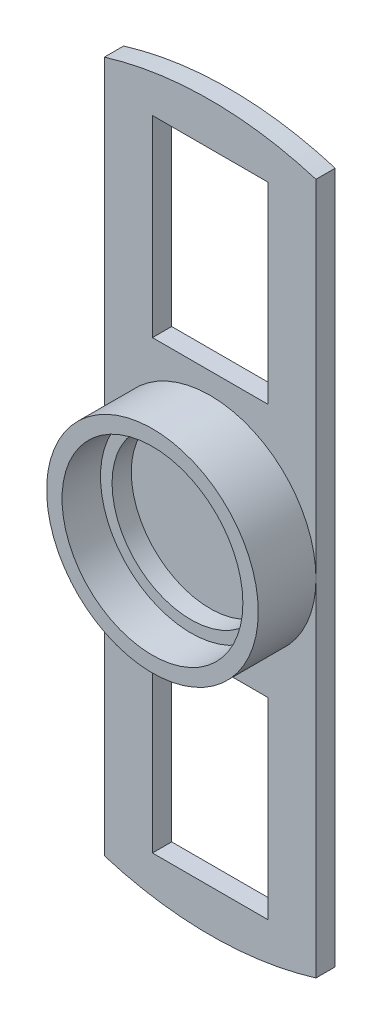
ISO-10303-21;
HEADER;
FILE_DESCRIPTION(('STEP AP214'),'2;1');
FILE_NAME('part.step','',(''),(''),'','','');
FILE_SCHEMA(('AUTOMOTIVE_DESIGN { 1 0 10303 214 1 1 1 1 }'));
ENDSEC;
DATA;
#1=APPLICATION_CONTEXT('core data for automotive mechanical design processes');
#2=APPLICATION_PROTOCOL_DEFINITION('international standard','automotive_design',2000,#1);
#3=PRODUCT_CONTEXT('',#1,'mechanical');
#4=PRODUCT('Part','Part','',(#3));
#5=PRODUCT_RELATED_PRODUCT_CATEGORY('part','',(#4));
#6=PRODUCT_DEFINITION_FORMATION('','',#4);
#7=PRODUCT_DEFINITION_CONTEXT('part definition',#1,'design');
#8=PRODUCT_DEFINITION('design','',#6,#7);
#9=PRODUCT_DEFINITION_SHAPE('','',#8);
#10=(LENGTH_UNIT() NAMED_UNIT(*) SI_UNIT(.MILLI.,.METRE.));
#11=(NAMED_UNIT(*) PLANE_ANGLE_UNIT() SI_UNIT($,.RADIAN.));
#12=(NAMED_UNIT(*) SI_UNIT($,.STERADIAN.) SOLID_ANGLE_UNIT());
#13=UNCERTAINTY_MEASURE_WITH_UNIT(LENGTH_MEASURE(1.E-05),#10,'distance_accuracy_value','');
#14=(GEOMETRIC_REPRESENTATION_CONTEXT(3) GLOBAL_UNCERTAINTY_ASSIGNED_CONTEXT((#13)) GLOBAL_UNIT_ASSIGNED_CONTEXT((#10,
#11,#12)) REPRESENTATION_CONTEXT('',''));
#15=CARTESIAN_POINT('',(0.,0.,0.));
#16=DIRECTION('',(0.,0.,1.));
#17=DIRECTION('',(1.,0.,0.));
#18=AXIS2_PLACEMENT_3D('',#15,#16,#17);
#19=CARTESIAN_POINT('',(0.,0.,10.));
#20=DIRECTION('',(0.,0.,1.));
#21=DIRECTION('',(1.,0.,0.));
#22=AXIS2_PLACEMENT_3D('',#19,#20,#21);
#23=PLANE('',#22);
#24=CARTESIAN_POINT('',(0.,0.,10.));
#25=DIRECTION('',(0.,0.,1.));
#26=DIRECTION('',(1.,0.,0.));
#27=AXIS2_PLACEMENT_3D('',#24,#25,#26);
#28=CIRCLE('',#27,27.5);
#29=CARTESIAN_POINT('',(27.5,0.,10.));
#30=VERTEX_POINT('',#29);
#31=EDGE_CURVE('E226',#30,#30,#28,.T.);
#32=ORIENTED_EDGE('',*,*,#31,.T.);
#33=EDGE_LOOP('',(#32));
#34=FACE_BOUND('',#33,.T.);
#35=CARTESIAN_POINT('',(0.,0.,10.));
#36=DIRECTION('',(0.,0.,1.));
#37=DIRECTION('',(1.,0.,0.));
#38=AXIS2_PLACEMENT_3D('',#35,#36,#37);
#39=CIRCLE('',#38,23.5);
#40=CARTESIAN_POINT('',(23.5,0.,10.));
#41=VERTEX_POINT('',#40);
#42=EDGE_CURVE('E223',#41,#41,#39,.T.);
#43=ORIENTED_EDGE('',*,*,#42,.F.);
#44=EDGE_LOOP('',(#43));
#45=FACE_BOUND('',#44,.T.);
#46=ADVANCED_FACE('F33',(#34,#45),#23,.T.);
#47=CARTESIAN_POINT('',(0.,0.,10.));
#48=DIRECTION('',(0.,0.,-1.));
#49=DIRECTION('',(-1.,0.,0.));
#50=AXIS2_PLACEMENT_3D('',#47,#48,#49);
#51=CYLINDRICAL_SURFACE('',#50,27.5);
#52=ORIENTED_EDGE('',*,*,#31,.F.);
#53=EDGE_LOOP('',(#52));
#54=FACE_BOUND('',#53,.T.);
#55=CARTESIAN_POINT('',(0.,0.,-5.));
#56=DIRECTION('',(0.,0.,-1.));
#57=DIRECTION('',(-1.,0.,0.));
#58=AXIS2_PLACEMENT_3D('',#55,#56,#57);
#59=CIRCLE('',#58,27.5);
#60=CARTESIAN_POINT('',(-27.5,0.,-5.));
#61=VERTEX_POINT('',#60);
#62=CARTESIAN_POINT('',(27.5,0.,-5.));
#63=VERTEX_POINT('',#62);
#64=EDGE_CURVE('E219',#61,#63,#59,.T.);
#65=ORIENTED_EDGE('',*,*,#64,.F.);
#66=EDGE_CURVE('E218',#63,#61,#59,.T.);
#67=ORIENTED_EDGE('',*,*,#66,.F.);
#68=EDGE_LOOP('',(#65,#67));
#69=FACE_BOUND('',#68,.T.);
#70=ADVANCED_FACE('F35',(#54,#69),#51,.T.);
#71=CARTESIAN_POINT('',(0.,0.,10.));
#72=DIRECTION('',(0.,0.,-1.));
#73=DIRECTION('',(-1.,0.,0.));
#74=AXIS2_PLACEMENT_3D('',#71,#72,#73);
#75=CYLINDRICAL_SURFACE('',#74,23.5);
#76=ORIENTED_EDGE('',*,*,#42,.T.);
#77=EDGE_LOOP('',(#76));
#78=FACE_BOUND('',#77,.T.);
#79=CARTESIAN_POINT('',(0.,0.,0.));
#80=DIRECTION('',(0.,0.,1.));
#81=DIRECTION('',(1.,0.,0.));
#82=AXIS2_PLACEMENT_3D('',#79,#80,#81);
#83=CIRCLE('',#82,23.5);
#84=CARTESIAN_POINT('',(23.5,0.,0.));
#85=VERTEX_POINT('',#84);
#86=EDGE_CURVE('E222',#85,#85,#83,.T.);
#87=ORIENTED_EDGE('',*,*,#86,.F.);
#88=EDGE_LOOP('',(#87));
#89=FACE_BOUND('',#88,.T.);
#90=ADVANCED_FACE('F269',(#78,#89),#75,.F.);
#91=CARTESIAN_POINT('',(0.,0.,0.));
#92=DIRECTION('',(0.,0.,-1.));
#93=DIRECTION('',(-1.,0.,0.));
#94=AXIS2_PLACEMENT_3D('',#91,#92,#93);
#95=PLANE('',#94);
#96=CARTESIAN_POINT('',(0.,0.,0.));
#97=DIRECTION('',(0.,0.,-1.));
#98=DIRECTION('',(-1.,0.,0.));
#99=AXIS2_PLACEMENT_3D('',#96,#97,#98);
#100=CIRCLE('',#99,20.5);
#101=CARTESIAN_POINT('',(-20.5,0.,0.));
#102=VERTEX_POINT('',#101);
#103=EDGE_CURVE('E215',#102,#102,#100,.T.);
#104=ORIENTED_EDGE('',*,*,#103,.T.);
#105=EDGE_LOOP('',(#104));
#106=FACE_BOUND('',#105,.T.);
#107=ORIENTED_EDGE('',*,*,#86,.T.);
#108=EDGE_LOOP('',(#107));
#109=FACE_BOUND('',#108,.T.);
#110=ADVANCED_FACE('F275',(#106,#109),#95,.F.);
#111=CARTESIAN_POINT('',(0.,0.,-5.));
#112=DIRECTION('',(0.,0.,1.));
#113=DIRECTION('',(1.,0.,0.));
#114=AXIS2_PLACEMENT_3D('',#111,#112,#113);
#115=CYLINDRICAL_SURFACE('',#114,20.5);
#116=CARTESIAN_POINT('',(0.,0.,-5.));
#117=DIRECTION('',(0.,0.,-1.));
#118=DIRECTION('',(-1.,0.,0.));
#119=AXIS2_PLACEMENT_3D('',#116,#117,#118);
#120=CIRCLE('',#119,20.5);
#121=CARTESIAN_POINT('',(-20.5,0.,-5.));
#122=VERTEX_POINT('',#121);
#123=EDGE_CURVE('E212',#122,#122,#120,.T.);
#124=ORIENTED_EDGE('',*,*,#123,.T.);
#125=EDGE_LOOP('',(#124));
#126=FACE_BOUND('',#125,.T.);
#127=ORIENTED_EDGE('',*,*,#103,.F.);
#128=EDGE_LOOP('',(#127));
#129=FACE_BOUND('',#128,.T.);
#130=ADVANCED_FACE('F279',(#126,#129),#115,.F.);
#131=CARTESIAN_POINT('',(0.,0.,-5.));
#132=DIRECTION('',(0.,0.,-1.));
#133=DIRECTION('',(-1.,0.,0.));
#134=AXIS2_PLACEMENT_3D('',#131,#132,#133);
#135=PLANE('',#134);
#136=ORIENTED_EDGE('',*,*,#123,.F.);
#137=EDGE_LOOP('',(#136));
#138=FACE_BOUND('',#137,.T.);
#139=ADVANCED_FACE('F283',(#138),#135,.F.);
#140=DIRECTION('',(1.,0.,0.));
#141=VECTOR('',#140,1.);
#142=CARTESIAN_POINT('',(-15.,33.,-5.));
#143=LINE('',#142,#141);
#144=CARTESIAN_POINT('',(-15.,33.,-5.));
#145=VERTEX_POINT('',#144);
#146=CARTESIAN_POINT('',(15.,33.,-5.));
#147=VERTEX_POINT('',#146);
#148=EDGE_CURVE('E162',#145,#147,#143,.T.);
#149=ORIENTED_EDGE('',*,*,#148,.F.);
#150=DIRECTION('',(0.,-1.,0.));
#151=VECTOR('',#150,1.);
#152=CARTESIAN_POINT('',(-15.,33.,-5.));
#153=LINE('',#152,#151);
#154=CARTESIAN_POINT('',(-15.,83.,-5.));
#155=VERTEX_POINT('',#154);
#156=EDGE_CURVE('E48',#155,#145,#153,.T.);
#157=ORIENTED_EDGE('',*,*,#156,.F.);
#158=DIRECTION('',(-1.,0.,0.));
#159=VECTOR('',#158,1.);
#160=CARTESIAN_POINT('',(-15.,83.,-5.));
#161=LINE('',#160,#159);
#162=CARTESIAN_POINT('',(15.,83.,-5.));
#163=VERTEX_POINT('',#162);
#164=EDGE_CURVE('E168',#163,#155,#161,.T.);
#165=ORIENTED_EDGE('',*,*,#164,.F.);
#166=DIRECTION('',(0.,1.,0.));
#167=VECTOR('',#166,1.);
#168=CARTESIAN_POINT('',(15.,33.,-5.));
#169=LINE('',#168,#167);
#170=EDGE_CURVE('E165',#147,#163,#169,.T.);
#171=ORIENTED_EDGE('',*,*,#170,.F.);
#172=EDGE_LOOP('',(#149,#157,#165,#171));
#173=FACE_BOUND('',#172,.T.);
#174=DIRECTION('',(0.,1.,0.));
#175=VECTOR('',#174,1.);
#176=CARTESIAN_POINT('',(-27.5,89.8874295994718,-5.));
#177=LINE('',#176,#175);
#178=CARTESIAN_POINT('',(-27.5,89.8874295994718,-5.));
#179=VERTEX_POINT('',#178);
#180=EDGE_CURVE('E198',#61,#179,#177,.T.);
#181=ORIENTED_EDGE('',*,*,#180,.F.);
#182=ORIENTED_EDGE('',*,*,#64,.T.);
#183=DIRECTION('',(0.,-1.,0.));
#184=VECTOR('',#183,1.);
#185=CARTESIAN_POINT('',(27.5,89.8874295994718,-5.));
#186=LINE('',#185,#184);
#187=CARTESIAN_POINT('',(27.5,89.8874295994718,-5.));
#188=VERTEX_POINT('',#187);
#189=EDGE_CURVE('E193',#188,#63,#186,.T.);
#190=ORIENTED_EDGE('',*,*,#189,.F.);
#191=CARTESIAN_POINT('',(0.,0.,-5.));
#192=DIRECTION('',(0.,0.,-1.));
#193=DIRECTION('',(-1.,0.,0.));
#194=AXIS2_PLACEMENT_3D('',#191,#192,#193);
#195=CIRCLE('',#194,94.);
#196=EDGE_CURVE('E158',#179,#188,#195,.T.);
#197=ORIENTED_EDGE('',*,*,#196,.F.);
#198=EDGE_LOOP('',(#181,#182,#190,#197));
#199=FACE_BOUND('',#198,.T.);
#200=ADVANCED_FACE('F303',(#173,#199),#135,.F.);
#201=DIRECTION('',(-1.,0.,0.));
#202=VECTOR('',#201,1.);
#203=CARTESIAN_POINT('',(15.,-33.,-5.));
#204=LINE('',#203,#202);
#205=CARTESIAN_POINT('',(15.,-33.,-5.));
#206=VERTEX_POINT('',#205);
#207=CARTESIAN_POINT('',(-15.,-33.,-5.));
#208=VERTEX_POINT('',#207);
#209=EDGE_CURVE('E144',#206,#208,#204,.T.);
#210=ORIENTED_EDGE('',*,*,#209,.F.);
#211=DIRECTION('',(0.,1.,0.));
#212=VECTOR('',#211,1.);
#213=CARTESIAN_POINT('',(15.,-33.,-5.));
#214=LINE('',#213,#212);
#215=CARTESIAN_POINT('',(15.,-83.,-5.));
#216=VERTEX_POINT('',#215);
#217=EDGE_CURVE('E56',#216,#206,#214,.T.);
#218=ORIENTED_EDGE('',*,*,#217,.F.);
#219=DIRECTION('',(1.,0.,0.));
#220=VECTOR('',#219,1.);
#221=CARTESIAN_POINT('',(15.,-83.,-5.));
#222=LINE('',#221,#220);
#223=CARTESIAN_POINT('',(-15.,-83.,-5.));
#224=VERTEX_POINT('',#223);
#225=EDGE_CURVE('E151',#224,#216,#222,.T.);
#226=ORIENTED_EDGE('',*,*,#225,.F.);
#227=DIRECTION('',(0.,-1.,0.));
#228=VECTOR('',#227,1.);
#229=CARTESIAN_POINT('',(-15.,-33.,-5.));
#230=LINE('',#229,#228);
#231=EDGE_CURVE('E134',#208,#224,#230,.T.);
#232=ORIENTED_EDGE('',*,*,#231,.F.);
#233=EDGE_LOOP('',(#210,#218,#226,#232));
#234=FACE_BOUND('',#233,.T.);
#235=CARTESIAN_POINT('',(27.5,-89.8874295994718,-5.));
#236=VERTEX_POINT('',#235);
#237=EDGE_CURVE('E192',#63,#236,#186,.T.);
#238=ORIENTED_EDGE('',*,*,#237,.F.);
#239=ORIENTED_EDGE('',*,*,#66,.T.);
#240=CARTESIAN_POINT('',(-27.5,-89.8874295994718,-5.));
#241=VERTEX_POINT('',#240);
#242=EDGE_CURVE('E183',#241,#61,#177,.T.);
#243=ORIENTED_EDGE('',*,*,#242,.F.);
#244=CARTESIAN_POINT('',(0.,0.,-5.));
#245=DIRECTION('',(0.,0.,-1.));
#246=DIRECTION('',(-1.,0.,0.));
#247=AXIS2_PLACEMENT_3D('',#244,#245,#246);
#248=CIRCLE('',#247,94.);
#249=EDGE_CURVE('E196',#236,#241,#248,.T.);
#250=ORIENTED_EDGE('',*,*,#249,.F.);
#251=EDGE_LOOP('',(#238,#239,#243,#250));
#252=FACE_BOUND('',#251,.T.);
#253=ADVANCED_FACE('F148',(#234,#252),#135,.F.);
#254=CARTESIAN_POINT('',(0.,0.,-10.));
#255=DIRECTION('',(0.,0.,1.));
#256=DIRECTION('',(1.,0.,0.));
#257=AXIS2_PLACEMENT_3D('',#254,#255,#256);
#258=CYLINDRICAL_SURFACE('',#257,94.);
#259=ORIENTED_EDGE('',*,*,#196,.T.);
#260=DIRECTION('',(0.,0.,1.));
#261=VECTOR('',#260,1.);
#262=CARTESIAN_POINT('',(27.5,89.8874295994718,-10.));
#263=LINE('',#262,#261);
#264=CARTESIAN_POINT('',(27.5,89.8874295994718,-10.));
#265=VERTEX_POINT('',#264);
#266=EDGE_CURVE('E209',#265,#188,#263,.T.);
#267=ORIENTED_EDGE('',*,*,#266,.F.);
#268=CARTESIAN_POINT('',(0.,0.,-10.));
#269=DIRECTION('',(0.,0.,-1.));
#270=DIRECTION('',(-1.,0.,0.));
#271=AXIS2_PLACEMENT_3D('',#268,#269,#270);
#272=CIRCLE('',#271,94.);
#273=CARTESIAN_POINT('',(-27.5,89.8874295994718,-10.));
#274=VERTEX_POINT('',#273);
#275=EDGE_CURVE('E179',#274,#265,#272,.T.);
#276=ORIENTED_EDGE('',*,*,#275,.F.);
#277=DIRECTION('',(0.,0.,1.));
#278=VECTOR('',#277,1.);
#279=CARTESIAN_POINT('',(-27.5,89.8874295994718,-10.));
#280=LINE('',#279,#278);
#281=EDGE_CURVE('E189',#274,#179,#280,.T.);
#282=ORIENTED_EDGE('',*,*,#281,.T.);
#283=EDGE_LOOP('',(#259,#267,#276,#282));
#284=FACE_BOUND('',#283,.T.);
#285=ADVANCED_FACE('F285',(#284),#258,.T.);
#286=CARTESIAN_POINT('',(27.5,89.8874295994718,-10.));
#287=DIRECTION('',(-1.,0.,0.));
#288=DIRECTION('',(0.,0.,1.));
#289=AXIS2_PLACEMENT_3D('',#286,#287,#288);
#290=PLANE('',#289);
#291=ORIENTED_EDGE('',*,*,#189,.T.);
#292=ORIENTED_EDGE('',*,*,#237,.T.);
#293=DIRECTION('',(0.,0.,1.));
#294=VECTOR('',#293,1.);
#295=CARTESIAN_POINT('',(27.5,-89.8874295994718,-10.));
#296=LINE('',#295,#294);
#297=CARTESIAN_POINT('',(27.5,-89.8874295994718,-10.));
#298=VERTEX_POINT('',#297);
#299=EDGE_CURVE('E206',#298,#236,#296,.T.);
#300=ORIENTED_EDGE('',*,*,#299,.F.);
#301=DIRECTION('',(0.,-1.,0.));
#302=VECTOR('',#301,1.);
#303=CARTESIAN_POINT('',(27.5,89.8874295994718,-10.));
#304=LINE('',#303,#302);
#305=EDGE_CURVE('E182',#265,#298,#304,.T.);
#306=ORIENTED_EDGE('',*,*,#305,.F.);
#307=ORIENTED_EDGE('',*,*,#266,.T.);
#308=EDGE_LOOP('',(#291,#292,#300,#306,#307));
#309=FACE_BOUND('',#308,.T.);
#310=ADVANCED_FACE('F288',(#309),#290,.F.);
#311=CARTESIAN_POINT('',(0.,0.,-10.));
#312=DIRECTION('',(0.,0.,1.));
#313=DIRECTION('',(1.,0.,0.));
#314=AXIS2_PLACEMENT_3D('',#311,#312,#313);
#315=CYLINDRICAL_SURFACE('',#314,94.);
#316=ORIENTED_EDGE('',*,*,#249,.T.);
#317=DIRECTION('',(0.,0.,1.));
#318=VECTOR('',#317,1.);
#319=CARTESIAN_POINT('',(-27.5,-89.8874295994718,-10.));
#320=LINE('',#319,#318);
#321=CARTESIAN_POINT('',(-27.5,-89.8874295994718,-10.));
#322=VERTEX_POINT('',#321);
#323=EDGE_CURVE('E203',#322,#241,#320,.T.);
#324=ORIENTED_EDGE('',*,*,#323,.F.);
#325=CARTESIAN_POINT('',(0.,0.,-10.));
#326=DIRECTION('',(0.,0.,-1.));
#327=DIRECTION('',(-1.,0.,0.));
#328=AXIS2_PLACEMENT_3D('',#325,#326,#327);
#329=CIRCLE('',#328,94.);
#330=EDGE_CURVE('E185',#298,#322,#329,.T.);
#331=ORIENTED_EDGE('',*,*,#330,.F.);
#332=ORIENTED_EDGE('',*,*,#299,.T.);
#333=EDGE_LOOP('',(#316,#324,#331,#332));
#334=FACE_BOUND('',#333,.T.);
#335=ADVANCED_FACE('F292',(#334),#315,.T.);
#336=CARTESIAN_POINT('',(-27.5,89.8874295994718,-10.));
#337=DIRECTION('',(1.,0.,0.));
#338=DIRECTION('',(0.,0.,-1.));
#339=AXIS2_PLACEMENT_3D('',#336,#337,#338);
#340=PLANE('',#339);
#341=ORIENTED_EDGE('',*,*,#242,.T.);
#342=ORIENTED_EDGE('',*,*,#180,.T.);
#343=ORIENTED_EDGE('',*,*,#281,.F.);
#344=DIRECTION('',(0.,1.,0.));
#345=VECTOR('',#344,1.);
#346=CARTESIAN_POINT('',(-27.5,89.8874295994718,-10.));
#347=LINE('',#346,#345);
#348=EDGE_CURVE('E187',#322,#274,#347,.T.);
#349=ORIENTED_EDGE('',*,*,#348,.F.);
#350=ORIENTED_EDGE('',*,*,#323,.T.);
#351=EDGE_LOOP('',(#341,#342,#343,#349,#350));
#352=FACE_BOUND('',#351,.T.);
#353=ADVANCED_FACE('F296',(#352),#340,.F.);
#354=CARTESIAN_POINT('',(0.,0.,-10.));
#355=DIRECTION('',(0.,0.,-1.));
#356=DIRECTION('',(-1.,0.,0.));
#357=AXIS2_PLACEMENT_3D('',#354,#355,#356);
#358=PLANE('',#357);
#359=DIRECTION('',(0.,-1.,0.));
#360=VECTOR('',#359,1.);
#361=CARTESIAN_POINT('',(15.,0.,-10.));
#362=LINE('',#361,#360);
#363=CARTESIAN_POINT('',(15.,-33.,-10.));
#364=VERTEX_POINT('',#363);
#365=CARTESIAN_POINT('',(15.,-83.,-10.));
#366=VERTEX_POINT('',#365);
#367=EDGE_CURVE('E11',#364,#366,#362,.T.);
#368=ORIENTED_EDGE('',*,*,#367,.F.);
#369=DIRECTION('',(1.,0.,0.));
#370=VECTOR('',#369,1.);
#371=CARTESIAN_POINT('',(0.,-33.,-10.));
#372=LINE('',#371,#370);
#373=CARTESIAN_POINT('',(-15.,-33.,-10.));
#374=VERTEX_POINT('',#373);
#375=EDGE_CURVE('E240',#374,#364,#372,.T.);
#376=ORIENTED_EDGE('',*,*,#375,.F.);
#377=DIRECTION('',(0.,1.,0.));
#378=VECTOR('',#377,1.);
#379=CARTESIAN_POINT('',(-15.,0.,-10.));
#380=LINE('',#379,#378);
#381=CARTESIAN_POINT('',(-15.,-83.,-10.));
#382=VERTEX_POINT('',#381);
#383=EDGE_CURVE('E137',#382,#374,#380,.T.);
#384=ORIENTED_EDGE('',*,*,#383,.F.);
#385=DIRECTION('',(-1.,0.,0.));
#386=VECTOR('',#385,1.);
#387=CARTESIAN_POINT('',(0.,-83.,-10.));
#388=LINE('',#387,#386);
#389=EDGE_CURVE('E41',#366,#382,#388,.T.);
#390=ORIENTED_EDGE('',*,*,#389,.F.);
#391=EDGE_LOOP('',(#368,#376,#384,#390));
#392=FACE_BOUND('',#391,.T.);
#393=DIRECTION('',(0.,1.,0.));
#394=VECTOR('',#393,1.);
#395=CARTESIAN_POINT('',(-15.,0.,-10.));
#396=LINE('',#395,#394);
#397=CARTESIAN_POINT('',(-15.,33.,-10.));
#398=VERTEX_POINT('',#397);
#399=CARTESIAN_POINT('',(-15.,83.,-10.));
#400=VERTEX_POINT('',#399);
#401=EDGE_CURVE('E238',#398,#400,#396,.T.);
#402=ORIENTED_EDGE('',*,*,#401,.F.);
#403=DIRECTION('',(-1.,0.,0.));
#404=VECTOR('',#403,1.);
#405=CARTESIAN_POINT('',(0.,33.,-10.));
#406=LINE('',#405,#404);
#407=CARTESIAN_POINT('',(15.,33.,-10.));
#408=VERTEX_POINT('',#407);
#409=EDGE_CURVE('E231',#408,#398,#406,.T.);
#410=ORIENTED_EDGE('',*,*,#409,.F.);
#411=DIRECTION('',(0.,-1.,0.));
#412=VECTOR('',#411,1.);
#413=CARTESIAN_POINT('',(15.,0.,-10.));
#414=LINE('',#413,#412);
#415=CARTESIAN_POINT('',(15.,83.,-10.));
#416=VERTEX_POINT('',#415);
#417=EDGE_CURVE('E233',#416,#408,#414,.T.);
#418=ORIENTED_EDGE('',*,*,#417,.F.);
#419=DIRECTION('',(1.,0.,0.));
#420=VECTOR('',#419,1.);
#421=CARTESIAN_POINT('',(0.,83.,-10.));
#422=LINE('',#421,#420);
#423=EDGE_CURVE('E236',#400,#416,#422,.T.);
#424=ORIENTED_EDGE('',*,*,#423,.F.);
#425=EDGE_LOOP('',(#402,#410,#418,#424));
#426=FACE_BOUND('',#425,.T.);
#427=ORIENTED_EDGE('',*,*,#275,.T.);
#428=ORIENTED_EDGE('',*,*,#305,.T.);
#429=ORIENTED_EDGE('',*,*,#330,.T.);
#430=ORIENTED_EDGE('',*,*,#348,.T.);
#431=EDGE_LOOP('',(#427,#428,#429,#430));
#432=FACE_BOUND('',#431,.T.);
#433=ADVANCED_FACE('F248',(#392,#426,#432),#358,.T.);
#434=CARTESIAN_POINT('',(-15.,33.,-15.));
#435=DIRECTION('',(-1.,0.,0.));
#436=DIRECTION('',(0.,0.,1.));
#437=AXIS2_PLACEMENT_3D('',#434,#435,#436);
#438=PLANE('',#437);
#439=ORIENTED_EDGE('',*,*,#401,.T.);
#440=DIRECTION('',(0.,0.,1.));
#441=VECTOR('',#440,1.);
#442=CARTESIAN_POINT('',(-15.,83.,-15.));
#443=LINE('',#442,#441);
#444=EDGE_CURVE('E172',#400,#155,#443,.T.);
#445=ORIENTED_EDGE('',*,*,#444,.T.);
#446=ORIENTED_EDGE('',*,*,#156,.T.);
#447=DIRECTION('',(0.,0.,1.));
#448=VECTOR('',#447,1.);
#449=CARTESIAN_POINT('',(-15.,33.,-15.));
#450=LINE('',#449,#448);
#451=EDGE_CURVE('E171',#398,#145,#450,.T.);
#452=ORIENTED_EDGE('',*,*,#451,.F.);
#453=EDGE_LOOP('',(#439,#445,#446,#452));
#454=FACE_BOUND('',#453,.T.);
#455=ADVANCED_FACE('F307',(#454),#438,.F.);
#456=CARTESIAN_POINT('',(-15.,83.,-15.));
#457=DIRECTION('',(0.,1.,0.));
#458=DIRECTION('',(0.,0.,1.));
#459=AXIS2_PLACEMENT_3D('',#456,#457,#458);
#460=PLANE('',#459);
#461=ORIENTED_EDGE('',*,*,#423,.T.);
#462=DIRECTION('',(0.,0.,1.));
#463=VECTOR('',#462,1.);
#464=CARTESIAN_POINT('',(15.,83.,-15.));
#465=LINE('',#464,#463);
#466=EDGE_CURVE('E174',#416,#163,#465,.T.);
#467=ORIENTED_EDGE('',*,*,#466,.T.);
#468=ORIENTED_EDGE('',*,*,#164,.T.);
#469=ORIENTED_EDGE('',*,*,#444,.F.);
#470=EDGE_LOOP('',(#461,#467,#468,#469));
#471=FACE_BOUND('',#470,.T.);
#472=ADVANCED_FACE('F309',(#471),#460,.F.);
#473=CARTESIAN_POINT('',(15.,33.,-15.));
#474=DIRECTION('',(1.,0.,0.));
#475=DIRECTION('',(0.,0.,-1.));
#476=AXIS2_PLACEMENT_3D('',#473,#474,#475);
#477=PLANE('',#476);
#478=ORIENTED_EDGE('',*,*,#417,.T.);
#479=DIRECTION('',(0.,0.,1.));
#480=VECTOR('',#479,1.);
#481=CARTESIAN_POINT('',(15.,33.,-15.));
#482=LINE('',#481,#480);
#483=EDGE_CURVE('E176',#408,#147,#482,.T.);
#484=ORIENTED_EDGE('',*,*,#483,.T.);
#485=ORIENTED_EDGE('',*,*,#170,.T.);
#486=ORIENTED_EDGE('',*,*,#466,.F.);
#487=EDGE_LOOP('',(#478,#484,#485,#486));
#488=FACE_BOUND('',#487,.T.);
#489=ADVANCED_FACE('F259',(#488),#477,.F.);
#490=CARTESIAN_POINT('',(-15.,33.,-15.));
#491=DIRECTION('',(0.,-1.,0.));
#492=DIRECTION('',(0.,0.,-1.));
#493=AXIS2_PLACEMENT_3D('',#490,#491,#492);
#494=PLANE('',#493);
#495=ORIENTED_EDGE('',*,*,#409,.T.);
#496=ORIENTED_EDGE('',*,*,#451,.T.);
#497=ORIENTED_EDGE('',*,*,#148,.T.);
#498=ORIENTED_EDGE('',*,*,#483,.F.);
#499=EDGE_LOOP('',(#495,#496,#497,#498));
#500=FACE_BOUND('',#499,.T.);
#501=ADVANCED_FACE('F252',(#500),#494,.F.);
#502=CARTESIAN_POINT('',(15.,-33.,-15.));
#503=DIRECTION('',(1.,0.,0.));
#504=DIRECTION('',(0.,1.,0.));
#505=AXIS2_PLACEMENT_3D('',#502,#503,#504);
#506=PLANE('',#505);
#507=ORIENTED_EDGE('',*,*,#367,.T.);
#508=DIRECTION('',(0.,0.,1.));
#509=VECTOR('',#508,1.);
#510=CARTESIAN_POINT('',(15.,-83.,-15.));
#511=LINE('',#510,#509);
#512=EDGE_CURVE('E156',#366,#216,#511,.T.);
#513=ORIENTED_EDGE('',*,*,#512,.T.);
#514=ORIENTED_EDGE('',*,*,#217,.T.);
#515=DIRECTION('',(0.,0.,1.));
#516=VECTOR('',#515,1.);
#517=CARTESIAN_POINT('',(15.,-33.,-15.));
#518=LINE('',#517,#516);
#519=EDGE_CURVE('E141',#364,#206,#518,.T.);
#520=ORIENTED_EDGE('',*,*,#519,.F.);
#521=EDGE_LOOP('',(#507,#513,#514,#520));
#522=FACE_BOUND('',#521,.T.);
#523=ADVANCED_FACE('F250',(#522),#506,.F.);
#524=CARTESIAN_POINT('',(15.,-83.,-15.));
#525=DIRECTION('',(0.,-1.,0.));
#526=DIRECTION('',(0.,0.,-1.));
#527=AXIS2_PLACEMENT_3D('',#524,#525,#526);
#528=PLANE('',#527);
#529=ORIENTED_EDGE('',*,*,#389,.T.);
#530=DIRECTION('',(0.,0.,1.));
#531=VECTOR('',#530,1.);
#532=CARTESIAN_POINT('',(-15.,-83.,-15.));
#533=LINE('',#532,#531);
#534=EDGE_CURVE('E140',#382,#224,#533,.T.);
#535=ORIENTED_EDGE('',*,*,#534,.T.);
#536=ORIENTED_EDGE('',*,*,#225,.T.);
#537=ORIENTED_EDGE('',*,*,#512,.F.);
#538=EDGE_LOOP('',(#529,#535,#536,#537));
#539=FACE_BOUND('',#538,.T.);
#540=ADVANCED_FACE('F245',(#539),#528,.F.);
#541=CARTESIAN_POINT('',(-15.,-33.,-15.));
#542=DIRECTION('',(-1.,0.,0.));
#543=DIRECTION('',(0.,-1.,0.));
#544=AXIS2_PLACEMENT_3D('',#541,#542,#543);
#545=PLANE('',#544);
#546=ORIENTED_EDGE('',*,*,#383,.T.);
#547=DIRECTION('',(0.,0.,1.));
#548=VECTOR('',#547,1.);
#549=CARTESIAN_POINT('',(-15.,-33.,-15.));
#550=LINE('',#549,#548);
#551=EDGE_CURVE('E129',#374,#208,#550,.T.);
#552=ORIENTED_EDGE('',*,*,#551,.T.);
#553=ORIENTED_EDGE('',*,*,#231,.T.);
#554=ORIENTED_EDGE('',*,*,#534,.F.);
#555=EDGE_LOOP('',(#546,#552,#553,#554));
#556=FACE_BOUND('',#555,.T.);
#557=ADVANCED_FACE('F131',(#556),#545,.F.);
#558=CARTESIAN_POINT('',(15.,-33.,-15.));
#559=DIRECTION('',(0.,1.,0.));
#560=DIRECTION('',(0.,0.,1.));
#561=AXIS2_PLACEMENT_3D('',#558,#559,#560);
#562=PLANE('',#561);
#563=ORIENTED_EDGE('',*,*,#375,.T.);
#564=ORIENTED_EDGE('',*,*,#519,.T.);
#565=ORIENTED_EDGE('',*,*,#209,.T.);
#566=ORIENTED_EDGE('',*,*,#551,.F.);
#567=EDGE_LOOP('',(#563,#564,#565,#566));
#568=FACE_BOUND('',#567,.T.);
#569=ADVANCED_FACE('F145',(#568),#562,.F.);
#570=CLOSED_SHELL('',(#46,#70,#90,#110,#130,#139,#200,#253,#285,#310,#335,#353,#433,#455,#472,
#489,#501,#523,#540,#557,#569));
#571=MANIFOLD_SOLID_BREP('B2',#570);
#572=ADVANCED_BREP_SHAPE_REPRESENTATION('',(#18,#571),#14);
#573=SHAPE_DEFINITION_REPRESENTATION(#9,#572);
ENDSEC;
END-ISO-10303-21;
